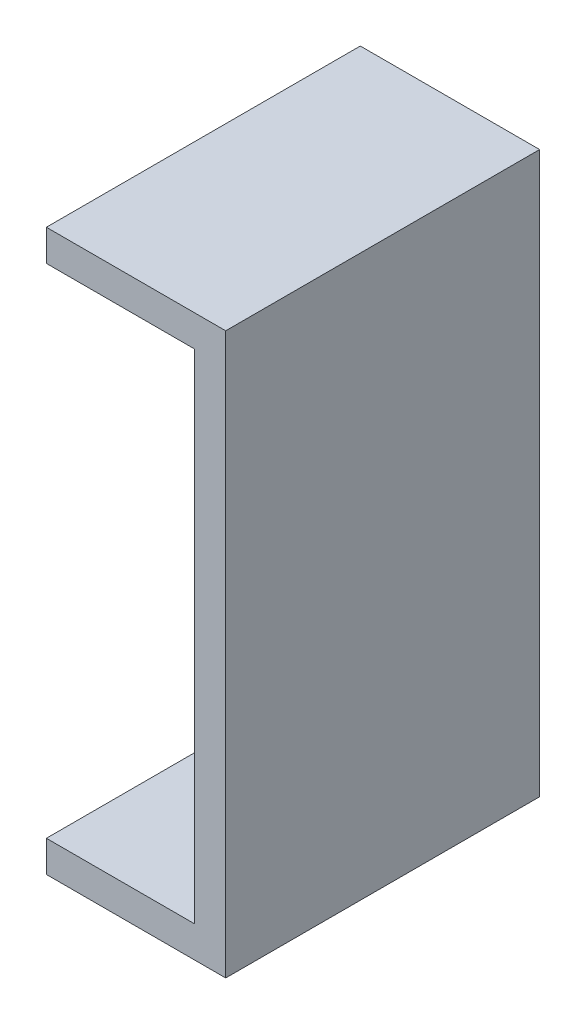
ISO-10303-21;
HEADER;
FILE_DESCRIPTION(('STEP AP214'),'2;1');
FILE_NAME('part.step','',(''),(''),'','','');
FILE_SCHEMA(('AUTOMOTIVE_DESIGN { 1 0 10303 214 1 1 1 1 }'));
ENDSEC;
DATA;
#1=APPLICATION_CONTEXT('core data for automotive mechanical design processes');
#2=APPLICATION_PROTOCOL_DEFINITION('international standard','automotive_design',2000,#1);
#3=PRODUCT_CONTEXT('',#1,'mechanical');
#4=PRODUCT('Part','Part','',(#3));
#5=PRODUCT_RELATED_PRODUCT_CATEGORY('part','',(#4));
#6=PRODUCT_DEFINITION_FORMATION('','',#4);
#7=PRODUCT_DEFINITION_CONTEXT('part definition',#1,'design');
#8=PRODUCT_DEFINITION('design','',#6,#7);
#9=PRODUCT_DEFINITION_SHAPE('','',#8);
#10=(LENGTH_UNIT() NAMED_UNIT(*) SI_UNIT(.MILLI.,.METRE.));
#11=(NAMED_UNIT(*) PLANE_ANGLE_UNIT() SI_UNIT($,.RADIAN.));
#12=(NAMED_UNIT(*) SI_UNIT($,.STERADIAN.) SOLID_ANGLE_UNIT());
#13=UNCERTAINTY_MEASURE_WITH_UNIT(LENGTH_MEASURE(1.E-05),#10,'distance_accuracy_value','');
#14=(GEOMETRIC_REPRESENTATION_CONTEXT(3) GLOBAL_UNCERTAINTY_ASSIGNED_CONTEXT((#13)) GLOBAL_UNIT_ASSIGNED_CONTEXT((#10,
#11,#12)) REPRESENTATION_CONTEXT('',''));
#15=CARTESIAN_POINT('',(0.,0.,0.));
#16=DIRECTION('',(0.,0.,1.));
#17=DIRECTION('',(1.,0.,0.));
#18=AXIS2_PLACEMENT_3D('',#15,#16,#17);
#19=CARTESIAN_POINT('',(-1.99949054,5.55050706,0.));
#20=DIRECTION('',(-1.,0.,0.));
#21=DIRECTION('',(0.,0.,1.));
#22=AXIS2_PLACEMENT_3D('',#19,#20,#21);
#23=PLANE('',#22);
#24=DIRECTION('',(0.,0.,1.));
#25=VECTOR('',#24,1.);
#26=CARTESIAN_POINT('',(-1.99949054,6.2494922,0.));
#27=LINE('',#26,#25);
#28=CARTESIAN_POINT('',(-1.99949054,6.2494922,0.));
#29=VERTEX_POINT('',#28);
#30=CARTESIAN_POINT('',(-1.99949054,6.2494922,7.));
#31=VERTEX_POINT('',#30);
#32=EDGE_CURVE('E85',#29,#31,#27,.T.);
#33=ORIENTED_EDGE('',*,*,#32,.F.);
#34=DIRECTION('',(0.,1.,0.));
#35=VECTOR('',#34,1.);
#36=CARTESIAN_POINT('',(-1.99949054,5.55050706,0.));
#37=LINE('',#36,#35);
#38=CARTESIAN_POINT('',(-1.99949054,5.55050706,0.));
#39=VERTEX_POINT('',#38);
#40=EDGE_CURVE('E90',#29,#39,#37,.F.);
#41=ORIENTED_EDGE('',*,*,#40,.T.);
#42=DIRECTION('',(0.,0.,-1.));
#43=VECTOR('',#42,1.);
#44=CARTESIAN_POINT('',(-1.99949054,5.55050706,0.));
#45=LINE('',#44,#43);
#46=CARTESIAN_POINT('',(-1.99949054,5.55050706,7.));
#47=VERTEX_POINT('',#46);
#48=EDGE_CURVE('E88',#47,#39,#45,.T.);
#49=ORIENTED_EDGE('',*,*,#48,.F.);
#50=DIRECTION('',(0.,1.,0.));
#51=VECTOR('',#50,1.);
#52=CARTESIAN_POINT('',(-1.99949054,5.55050706,7.));
#53=LINE('',#52,#51);
#54=EDGE_CURVE('E20',#47,#31,#53,.T.);
#55=ORIENTED_EDGE('',*,*,#54,.T.);
#56=EDGE_LOOP('',(#33,#41,#49,#55));
#57=FACE_BOUND('',#56,.T.);
#58=ADVANCED_FACE('F17',(#57),#23,.T.);
#59=CARTESIAN_POINT('',(-1.99949054,-6.2494922,0.));
#60=DIRECTION('',(-1.,0.,0.));
#61=DIRECTION('',(0.,0.,1.));
#62=AXIS2_PLACEMENT_3D('',#59,#60,#61);
#63=PLANE('',#62);
#64=DIRECTION('',(0.,0.,1.));
#65=VECTOR('',#64,1.);
#66=CARTESIAN_POINT('',(-1.99949054,-5.55050706,0.));
#67=LINE('',#66,#65);
#68=CARTESIAN_POINT('',(-1.99949054,-5.55050706,0.));
#69=VERTEX_POINT('',#68);
#70=CARTESIAN_POINT('',(-1.99949054,-5.55050706,7.));
#71=VERTEX_POINT('',#70);
#72=EDGE_CURVE('E111',#69,#71,#67,.T.);
#73=ORIENTED_EDGE('',*,*,#72,.F.);
#74=DIRECTION('',(0.,1.,0.));
#75=VECTOR('',#74,1.);
#76=CARTESIAN_POINT('',(-1.99949054,-6.2494922,0.));
#77=LINE('',#76,#75);
#78=CARTESIAN_POINT('',(-1.99949054,-6.2494922,0.));
#79=VERTEX_POINT('',#78);
#80=EDGE_CURVE('E117',#69,#79,#77,.F.);
#81=ORIENTED_EDGE('',*,*,#80,.T.);
#82=DIRECTION('',(0.,0.,-1.));
#83=VECTOR('',#82,1.);
#84=CARTESIAN_POINT('',(-1.99949054,-6.2494922,0.));
#85=LINE('',#84,#83);
#86=CARTESIAN_POINT('',(-1.99949054,-6.2494922,7.));
#87=VERTEX_POINT('',#86);
#88=EDGE_CURVE('E130',#87,#79,#85,.T.);
#89=ORIENTED_EDGE('',*,*,#88,.F.);
#90=DIRECTION('',(0.,1.,0.));
#91=VECTOR('',#90,1.);
#92=CARTESIAN_POINT('',(-1.99949054,-6.2494922,7.));
#93=LINE('',#92,#91);
#94=EDGE_CURVE('E138',#71,#87,#93,.F.);
#95=ORIENTED_EDGE('',*,*,#94,.F.);
#96=EDGE_LOOP('',(#73,#81,#89,#95));
#97=FACE_BOUND('',#96,.T.);
#98=ADVANCED_FACE('F154',(#97),#63,.T.);
#99=CARTESIAN_POINT('',(1.30050794,5.55050706,0.));
#100=DIRECTION('',(0.,-1.,0.));
#101=DIRECTION('',(0.,0.,-1.));
#102=AXIS2_PLACEMENT_3D('',#99,#100,#101);
#103=PLANE('',#102);
#104=ORIENTED_EDGE('',*,*,#48,.T.);
#105=DIRECTION('',(1.,0.,0.));
#106=VECTOR('',#105,1.);
#107=CARTESIAN_POINT('',(1.99949308,5.55050706,0.));
#108=LINE('',#107,#106);
#109=CARTESIAN_POINT('',(1.30050794,5.55050706,0.));
#110=VERTEX_POINT('',#109);
#111=EDGE_CURVE('E122',#39,#110,#108,.T.);
#112=ORIENTED_EDGE('',*,*,#111,.T.);
#113=DIRECTION('',(0.,0.,1.));
#114=VECTOR('',#113,1.);
#115=CARTESIAN_POINT('',(1.30050794,5.55050706,0.));
#116=LINE('',#115,#114);
#117=CARTESIAN_POINT('',(1.30050794,5.55050706,7.));
#118=VERTEX_POINT('',#117);
#119=EDGE_CURVE('E113',#118,#110,#116,.F.);
#120=ORIENTED_EDGE('',*,*,#119,.F.);
#121=DIRECTION('',(1.,0.,0.));
#122=VECTOR('',#121,1.);
#123=CARTESIAN_POINT('',(1.99949308,5.55050706,7.));
#124=LINE('',#123,#122);
#125=EDGE_CURVE('E103',#47,#118,#124,.T.);
#126=ORIENTED_EDGE('',*,*,#125,.F.);
#127=EDGE_LOOP('',(#104,#112,#120,#126));
#128=FACE_BOUND('',#127,.T.);
#129=ADVANCED_FACE('F121',(#128),#103,.T.);
#130=CARTESIAN_POINT('',(1.30050794,-5.55050706,0.));
#131=DIRECTION('',(-1.,0.,0.));
#132=DIRECTION('',(0.,0.,1.));
#133=AXIS2_PLACEMENT_3D('',#130,#131,#132);
#134=PLANE('',#133);
#135=ORIENTED_EDGE('',*,*,#119,.T.);
#136=DIRECTION('',(0.,1.,0.));
#137=VECTOR('',#136,1.);
#138=CARTESIAN_POINT('',(1.30050794,-6.2494922,0.));
#139=LINE('',#138,#137);
#140=CARTESIAN_POINT('',(1.30050794,-5.55050706,0.));
#141=VERTEX_POINT('',#140);
#142=EDGE_CURVE('E126',#110,#141,#139,.F.);
#143=ORIENTED_EDGE('',*,*,#142,.T.);
#144=DIRECTION('',(0.,0.,1.));
#145=VECTOR('',#144,1.);
#146=CARTESIAN_POINT('',(1.30050794,-5.55050706,0.));
#147=LINE('',#146,#145);
#148=CARTESIAN_POINT('',(1.30050794,-5.55050706,7.));
#149=VERTEX_POINT('',#148);
#150=EDGE_CURVE('E97',#149,#141,#147,.F.);
#151=ORIENTED_EDGE('',*,*,#150,.F.);
#152=DIRECTION('',(0.,1.,0.));
#153=VECTOR('',#152,1.);
#154=CARTESIAN_POINT('',(1.30050794,-6.2494922,7.));
#155=LINE('',#154,#153);
#156=EDGE_CURVE('E105',#118,#149,#155,.F.);
#157=ORIENTED_EDGE('',*,*,#156,.F.);
#158=EDGE_LOOP('',(#135,#143,#151,#157));
#159=FACE_BOUND('',#158,.T.);
#160=ADVANCED_FACE('F146',(#159),#134,.T.);
#161=CARTESIAN_POINT('',(-1.99949054,-5.55050706,0.));
#162=DIRECTION('',(0.,1.,0.));
#163=DIRECTION('',(0.,0.,1.));
#164=AXIS2_PLACEMENT_3D('',#161,#162,#163);
#165=PLANE('',#164);
#166=ORIENTED_EDGE('',*,*,#150,.T.);
#167=DIRECTION('',(1.,0.,0.));
#168=VECTOR('',#167,1.);
#169=CARTESIAN_POINT('',(1.99949308,-5.55050706,0.));
#170=LINE('',#169,#168);
#171=EDGE_CURVE('E128',#141,#69,#170,.F.);
#172=ORIENTED_EDGE('',*,*,#171,.T.);
#173=ORIENTED_EDGE('',*,*,#72,.T.);
#174=DIRECTION('',(1.,0.,0.));
#175=VECTOR('',#174,1.);
#176=CARTESIAN_POINT('',(1.99949308,-5.55050706,7.));
#177=LINE('',#176,#175);
#178=EDGE_CURVE('E140',#149,#71,#177,.F.);
#179=ORIENTED_EDGE('',*,*,#178,.F.);
#180=EDGE_LOOP('',(#166,#172,#173,#179));
#181=FACE_BOUND('',#180,.T.);
#182=ADVANCED_FACE('F149',(#181),#165,.T.);
#183=CARTESIAN_POINT('',(-1.99949054,6.2494922,0.));
#184=DIRECTION('',(0.,1.,0.));
#185=DIRECTION('',(0.,0.,1.));
#186=AXIS2_PLACEMENT_3D('',#183,#184,#185);
#187=PLANE('',#186);
#188=DIRECTION('',(0.,0.,-1.));
#189=VECTOR('',#188,1.);
#190=CARTESIAN_POINT('',(1.99949308,6.2494922,0.));
#191=LINE('',#190,#189);
#192=CARTESIAN_POINT('',(1.99949308,6.2494922,0.));
#193=VERTEX_POINT('',#192);
#194=CARTESIAN_POINT('',(1.99949308,6.2494922,7.));
#195=VERTEX_POINT('',#194);
#196=EDGE_CURVE('E160',#193,#195,#191,.F.);
#197=ORIENTED_EDGE('',*,*,#196,.F.);
#198=DIRECTION('',(1.,0.,0.));
#199=VECTOR('',#198,1.);
#200=CARTESIAN_POINT('',(1.99949308,6.2494922,0.));
#201=LINE('',#200,#199);
#202=EDGE_CURVE('E96',#193,#29,#201,.F.);
#203=ORIENTED_EDGE('',*,*,#202,.T.);
#204=ORIENTED_EDGE('',*,*,#32,.T.);
#205=DIRECTION('',(1.,0.,0.));
#206=VECTOR('',#205,1.);
#207=CARTESIAN_POINT('',(1.99949308,6.2494922,7.));
#208=LINE('',#207,#206);
#209=EDGE_CURVE('E93',#195,#31,#208,.F.);
#210=ORIENTED_EDGE('',*,*,#209,.F.);
#211=EDGE_LOOP('',(#197,#203,#204,#210));
#212=FACE_BOUND('',#211,.T.);
#213=ADVANCED_FACE('F92',(#212),#187,.T.);
#214=CARTESIAN_POINT('',(1.99949308,-6.2494922,7.));
#215=DIRECTION('',(0.,0.,1.));
#216=DIRECTION('',(1.,0.,0.));
#217=AXIS2_PLACEMENT_3D('',#214,#215,#216);
#218=PLANE('',#217);
#219=ORIENTED_EDGE('',*,*,#94,.T.);
#220=DIRECTION('',(1.,0.,0.));
#221=VECTOR('',#220,1.);
#222=CARTESIAN_POINT('',(1.99949308,-6.2494922,7.));
#223=LINE('',#222,#221);
#224=CARTESIAN_POINT('',(1.99949308,-6.2494922,7.));
#225=VERTEX_POINT('',#224);
#226=EDGE_CURVE('E135',#225,#87,#223,.F.);
#227=ORIENTED_EDGE('',*,*,#226,.F.);
#228=DIRECTION('',(0.,1.,0.));
#229=VECTOR('',#228,1.);
#230=CARTESIAN_POINT('',(1.99949308,6.2494922,7.));
#231=LINE('',#230,#229);
#232=EDGE_CURVE('E101',#195,#225,#231,.F.);
#233=ORIENTED_EDGE('',*,*,#232,.F.);
#234=ORIENTED_EDGE('',*,*,#209,.T.);
#235=ORIENTED_EDGE('',*,*,#54,.F.);
#236=ORIENTED_EDGE('',*,*,#125,.T.);
#237=ORIENTED_EDGE('',*,*,#156,.T.);
#238=ORIENTED_EDGE('',*,*,#178,.T.);
#239=EDGE_LOOP('',(#219,#227,#233,#234,#235,#236,#237,#238));
#240=FACE_BOUND('',#239,.T.);
#241=ADVANCED_FACE('F99',(#240),#218,.T.);
#242=CARTESIAN_POINT('',(1.99949308,-6.2494922,0.));
#243=DIRECTION('',(0.,-1.,0.));
#244=DIRECTION('',(0.,0.,-1.));
#245=AXIS2_PLACEMENT_3D('',#242,#243,#244);
#246=PLANE('',#245);
#247=ORIENTED_EDGE('',*,*,#88,.T.);
#248=DIRECTION('',(1.,0.,0.));
#249=VECTOR('',#248,1.);
#250=CARTESIAN_POINT('',(1.99949308,-6.2494922,0.));
#251=LINE('',#250,#249);
#252=CARTESIAN_POINT('',(1.99949308,-6.2494922,0.));
#253=VERTEX_POINT('',#252);
#254=EDGE_CURVE('E35',#79,#253,#251,.T.);
#255=ORIENTED_EDGE('',*,*,#254,.T.);
#256=DIRECTION('',(0.,0.,-1.));
#257=VECTOR('',#256,1.);
#258=CARTESIAN_POINT('',(1.99949308,-6.2494922,0.));
#259=LINE('',#258,#257);
#260=EDGE_CURVE('E26',#225,#253,#259,.T.);
#261=ORIENTED_EDGE('',*,*,#260,.F.);
#262=ORIENTED_EDGE('',*,*,#226,.T.);
#263=EDGE_LOOP('',(#247,#255,#261,#262));
#264=FACE_BOUND('',#263,.T.);
#265=ADVANCED_FACE('F156',(#264),#246,.T.);
#266=CARTESIAN_POINT('',(1.99949308,-6.2494922,0.));
#267=DIRECTION('',(0.,0.,1.));
#268=DIRECTION('',(1.,0.,0.));
#269=AXIS2_PLACEMENT_3D('',#266,#267,#268);
#270=PLANE('',#269);
#271=ORIENTED_EDGE('',*,*,#80,.F.);
#272=ORIENTED_EDGE('',*,*,#171,.F.);
#273=ORIENTED_EDGE('',*,*,#142,.F.);
#274=ORIENTED_EDGE('',*,*,#111,.F.);
#275=ORIENTED_EDGE('',*,*,#40,.F.);
#276=ORIENTED_EDGE('',*,*,#202,.F.);
#277=DIRECTION('',(0.,1.,0.));
#278=VECTOR('',#277,1.);
#279=CARTESIAN_POINT('',(1.99949308,6.2494922,0.));
#280=LINE('',#279,#278);
#281=EDGE_CURVE('E11',#253,#193,#280,.T.);
#282=ORIENTED_EDGE('',*,*,#281,.F.);
#283=ORIENTED_EDGE('',*,*,#254,.F.);
#284=EDGE_LOOP('',(#271,#272,#273,#274,#275,#276,#282,#283));
#285=FACE_BOUND('',#284,.T.);
#286=ADVANCED_FACE('F124',(#285),#270,.F.);
#287=CARTESIAN_POINT('',(1.99949308,6.2494922,0.));
#288=DIRECTION('',(1.,0.,0.));
#289=DIRECTION('',(0.,0.,-1.));
#290=AXIS2_PLACEMENT_3D('',#287,#288,#289);
#291=PLANE('',#290);
#292=ORIENTED_EDGE('',*,*,#260,.T.);
#293=ORIENTED_EDGE('',*,*,#281,.T.);
#294=ORIENTED_EDGE('',*,*,#196,.T.);
#295=ORIENTED_EDGE('',*,*,#232,.T.);
#296=EDGE_LOOP('',(#292,#293,#294,#295));
#297=FACE_BOUND('',#296,.T.);
#298=ADVANCED_FACE('F159',(#297),#291,.T.);
#299=CLOSED_SHELL('',(#58,#98,#129,#160,#182,#213,#241,#265,#286,#298));
#300=MANIFOLD_SOLID_BREP('B1',#299);
#301=ADVANCED_BREP_SHAPE_REPRESENTATION('',(#18,#300),#14);
#302=SHAPE_DEFINITION_REPRESENTATION(#9,#301);
ENDSEC;
END-ISO-10303-21;
